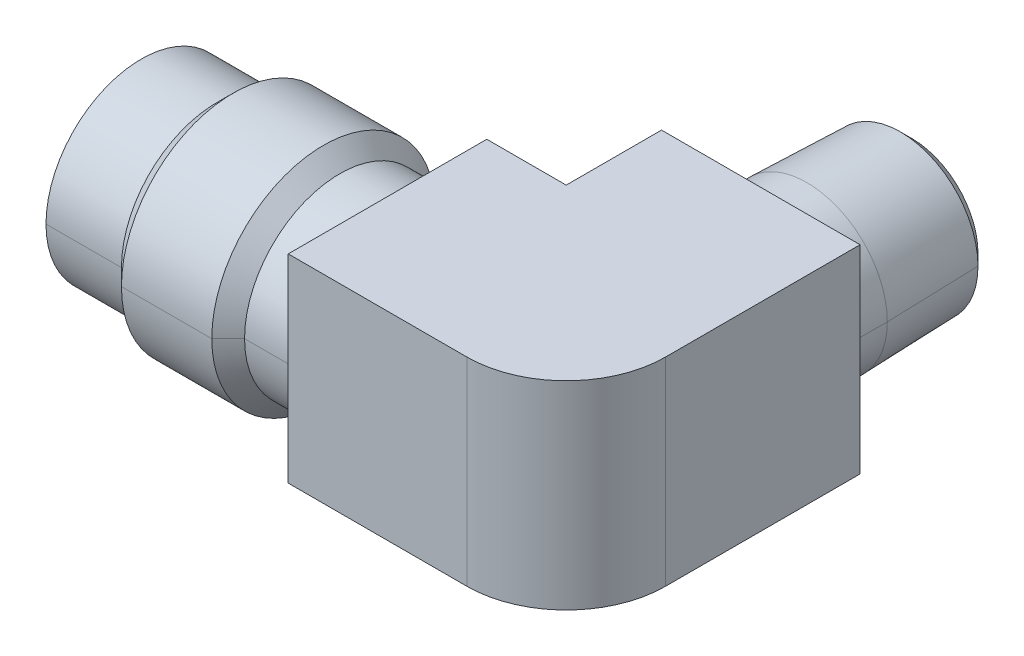
ISO-10303-21;
HEADER;
FILE_DESCRIPTION(('STEP AP214'),'2;1');
FILE_NAME('part.step','',(''),(''),'','','');
FILE_SCHEMA(('AUTOMOTIVE_DESIGN { 1 0 10303 214 1 1 1 1 }'));
ENDSEC;
DATA;
#1=APPLICATION_CONTEXT('core data for automotive mechanical design processes');
#2=APPLICATION_PROTOCOL_DEFINITION('international standard','automotive_design',2000,#1);
#3=PRODUCT_CONTEXT('',#1,'mechanical');
#4=PRODUCT('Part','Part','',(#3));
#5=PRODUCT_RELATED_PRODUCT_CATEGORY('part','',(#4));
#6=PRODUCT_DEFINITION_FORMATION('','',#4);
#7=PRODUCT_DEFINITION_CONTEXT('part definition',#1,'design');
#8=PRODUCT_DEFINITION('design','',#6,#7);
#9=PRODUCT_DEFINITION_SHAPE('','',#8);
#10=(LENGTH_UNIT() NAMED_UNIT(*) SI_UNIT(.MILLI.,.METRE.));
#11=(NAMED_UNIT(*) PLANE_ANGLE_UNIT() SI_UNIT($,.RADIAN.));
#12=(NAMED_UNIT(*) SI_UNIT($,.STERADIAN.) SOLID_ANGLE_UNIT());
#13=UNCERTAINTY_MEASURE_WITH_UNIT(LENGTH_MEASURE(1.E-05),#10,'distance_accuracy_value','');
#14=(GEOMETRIC_REPRESENTATION_CONTEXT(3) GLOBAL_UNCERTAINTY_ASSIGNED_CONTEXT((#13)) GLOBAL_UNIT_ASSIGNED_CONTEXT((#10,
#11,#12)) REPRESENTATION_CONTEXT('',''));
#15=CARTESIAN_POINT('',(0.,0.,0.));
#16=DIRECTION('',(0.,0.,1.));
#17=DIRECTION('',(1.,0.,0.));
#18=AXIS2_PLACEMENT_3D('',#15,#16,#17);
#19=CARTESIAN_POINT('',(27.178,0.,-18.74647));
#20=DIRECTION('',(0.,0.,1.));
#21=DIRECTION('',(-1.,0.,0.));
#22=AXIS2_PLACEMENT_3D('',#19,#20,#21);
#23=CONICAL_SURFACE('',#22,5.03914980109326,0.0311250383214112);
#24=DIRECTION('',(-0.0311200130745938,0.,0.999515655098127));
#25=VECTOR('',#24,1.);
#26=CARTESIAN_POINT('',(22.1388501989067,0.,-18.74647));
#27=LINE('',#26,#25);
#28=CARTESIAN_POINT('',(22.2208896002843,0.,-21.3814196002843));
#29=VERTEX_POINT('',#28);
#30=CARTESIAN_POINT('',(22.0345,0.,-15.39494));
#31=VERTEX_POINT('',#30);
#32=EDGE_CURVE('E18',#29,#31,#27,.T.);
#33=ORIENTED_EDGE('',*,*,#32,.F.);
#34=CARTESIAN_POINT('',(27.178,0.,-21.3814196002843));
#35=DIRECTION('',(0.,0.,1.));
#36=DIRECTION('',(-1.,0.,0.));
#37=AXIS2_PLACEMENT_3D('',#34,#35,#36);
#38=CIRCLE('',#37,4.9571103997157);
#39=CARTESIAN_POINT('',(32.1351103997157,0.,-21.3814196002843));
#40=VERTEX_POINT('',#39);
#41=EDGE_CURVE('E473',#29,#40,#38,.T.);
#42=ORIENTED_EDGE('',*,*,#41,.T.);
#43=DIRECTION('',(-0.0311200130745935,0.,-0.999515655098127));
#44=VECTOR('',#43,1.);
#45=CARTESIAN_POINT('',(32.2171498010933,0.,-18.74647));
#46=LINE('',#45,#44);
#47=CARTESIAN_POINT('',(32.3215,0.,-15.39494));
#48=VERTEX_POINT('',#47);
#49=EDGE_CURVE('E10',#48,#40,#46,.T.);
#50=ORIENTED_EDGE('',*,*,#49,.F.);
#51=CARTESIAN_POINT('',(27.178,0.,-15.39494));
#52=DIRECTION('',(0.,0.,1.));
#53=DIRECTION('',(-1.,0.,0.));
#54=AXIS2_PLACEMENT_3D('',#51,#52,#53);
#55=CIRCLE('',#54,5.1435);
#56=EDGE_CURVE('E446',#31,#48,#55,.T.);
#57=ORIENTED_EDGE('',*,*,#56,.F.);
#58=EDGE_LOOP('',(#33,#42,#50,#57));
#59=FACE_BOUND('',#58,.T.);
#60=ADVANCED_FACE('F15',(#59),#23,.T.);
#61=CARTESIAN_POINT('',(27.178,0.,-18.74647));
#62=DIRECTION('',(0.,0.,1.));
#63=DIRECTION('',(-1.,0.,0.));
#64=AXIS2_PLACEMENT_3D('',#61,#62,#63);
#65=CONICAL_SURFACE('',#64,5.03914980109326,0.0311250383214112);
#66=ORIENTED_EDGE('',*,*,#32,.T.);
#67=CARTESIAN_POINT('',(27.178,0.,-15.39494));
#68=DIRECTION('',(0.,0.,1.));
#69=DIRECTION('',(-1.,0.,0.));
#70=AXIS2_PLACEMENT_3D('',#67,#68,#69);
#71=CIRCLE('',#70,5.1435);
#72=EDGE_CURVE('E442',#48,#31,#71,.T.);
#73=ORIENTED_EDGE('',*,*,#72,.F.);
#74=ORIENTED_EDGE('',*,*,#49,.T.);
#75=CARTESIAN_POINT('',(27.178,0.,-21.3814196002843));
#76=DIRECTION('',(0.,0.,1.));
#77=DIRECTION('',(-1.,0.,0.));
#78=AXIS2_PLACEMENT_3D('',#75,#76,#77);
#79=CIRCLE('',#78,4.9571103997157);
#80=EDGE_CURVE('E472',#40,#29,#79,.T.);
#81=ORIENTED_EDGE('',*,*,#80,.T.);
#82=EDGE_LOOP('',(#66,#73,#74,#81));
#83=FACE_BOUND('',#82,.T.);
#84=ADVANCED_FACE('F497',(#83),#65,.T.);
#85=CARTESIAN_POINT('',(27.178,0.,-21.646515));
#86=DIRECTION('',(0.,0.,1.));
#87=DIRECTION('',(-1.,0.,0.));
#88=AXIS2_PLACEMENT_3D('',#85,#86,#87);
#89=CONICAL_SURFACE('',#88,4.692015,0.785398163397448);
#90=DIRECTION('',(0.707106781186548,0.,-0.707106781186547));
#91=VECTOR('',#90,1.);
#92=CARTESIAN_POINT('',(22.485985,0.,-21.646515));
#93=LINE('',#92,#91);
#94=CARTESIAN_POINT('',(22.93747,0.,-22.098));
#95=VERTEX_POINT('',#94);
#96=EDGE_CURVE('E469',#29,#95,#93,.T.);
#97=ORIENTED_EDGE('',*,*,#96,.T.);
#98=CARTESIAN_POINT('',(27.178,0.,-22.098));
#99=DIRECTION('',(0.,0.,-1.));
#100=DIRECTION('',(-1.,0.,0.));
#101=AXIS2_PLACEMENT_3D('',#98,#99,#100);
#102=CIRCLE('',#101,4.24053);
#103=CARTESIAN_POINT('',(31.41853,0.,-22.098));
#104=VERTEX_POINT('',#103);
#105=EDGE_CURVE('E346',#104,#95,#102,.T.);
#106=ORIENTED_EDGE('',*,*,#105,.F.);
#107=DIRECTION('',(0.707106781186548,0.,0.707106781186547));
#108=VECTOR('',#107,1.);
#109=CARTESIAN_POINT('',(31.870015,0.,-21.646515));
#110=LINE('',#109,#108);
#111=EDGE_CURVE('E478',#104,#40,#110,.T.);
#112=ORIENTED_EDGE('',*,*,#111,.T.);
#113=ORIENTED_EDGE('',*,*,#41,.F.);
#114=EDGE_LOOP('',(#97,#106,#112,#113));
#115=FACE_BOUND('',#114,.T.);
#116=ADVANCED_FACE('F503',(#115),#89,.T.);
#117=CARTESIAN_POINT('',(27.178,0.,-13.92047));
#118=DIRECTION('',(0.,0.,1.));
#119=DIRECTION('',(-1.,0.,0.));
#120=AXIS2_PLACEMENT_3D('',#117,#118,#119);
#121=CYLINDRICAL_SURFACE('',#120,5.1435);
#122=DIRECTION('',(0.,0.,1.));
#123=VECTOR('',#122,1.);
#124=CARTESIAN_POINT('',(22.0345,0.,-13.92047));
#125=LINE('',#124,#123);
#126=CARTESIAN_POINT('',(22.0345,0.,-12.446));
#127=VERTEX_POINT('',#126);
#128=EDGE_CURVE('E482',#31,#127,#125,.T.);
#129=ORIENTED_EDGE('',*,*,#128,.F.);
#130=ORIENTED_EDGE('',*,*,#56,.T.);
#131=DIRECTION('',(0.,0.,-1.));
#132=VECTOR('',#131,1.);
#133=CARTESIAN_POINT('',(32.3215,0.,-13.92047));
#134=LINE('',#133,#132);
#135=CARTESIAN_POINT('',(32.3215,0.,-12.446));
#136=VERTEX_POINT('',#135);
#137=EDGE_CURVE('E447',#136,#48,#134,.T.);
#138=ORIENTED_EDGE('',*,*,#137,.F.);
#139=CARTESIAN_POINT('',(27.178,0.,-12.446));
#140=DIRECTION('',(0.,0.,1.));
#141=DIRECTION('',(-1.,0.,0.));
#142=AXIS2_PLACEMENT_3D('',#139,#140,#141);
#143=CIRCLE('',#142,5.1435);
#144=EDGE_CURVE('E290',#127,#136,#143,.T.);
#145=ORIENTED_EDGE('',*,*,#144,.F.);
#146=EDGE_LOOP('',(#129,#130,#138,#145));
#147=FACE_BOUND('',#146,.T.);
#148=ADVANCED_FACE('F496',(#147),#121,.T.);
#149=CARTESIAN_POINT('',(27.178,0.,-13.92047));
#150=DIRECTION('',(0.,0.,1.));
#151=DIRECTION('',(-1.,0.,0.));
#152=AXIS2_PLACEMENT_3D('',#149,#150,#151);
#153=CYLINDRICAL_SURFACE('',#152,5.1435);
#154=ORIENTED_EDGE('',*,*,#128,.T.);
#155=CARTESIAN_POINT('',(27.178,0.,-12.446));
#156=DIRECTION('',(0.,0.,1.));
#157=DIRECTION('',(-1.,0.,0.));
#158=AXIS2_PLACEMENT_3D('',#155,#156,#157);
#159=CIRCLE('',#158,5.1435);
#160=EDGE_CURVE('E299',#136,#127,#159,.T.);
#161=ORIENTED_EDGE('',*,*,#160,.F.);
#162=ORIENTED_EDGE('',*,*,#137,.T.);
#163=ORIENTED_EDGE('',*,*,#72,.T.);
#164=EDGE_LOOP('',(#154,#161,#162,#163));
#165=FACE_BOUND('',#164,.T.);
#166=ADVANCED_FACE('F492',(#165),#153,.T.);
#167=CARTESIAN_POINT('',(27.178,0.,-21.646515));
#168=DIRECTION('',(0.,0.,1.));
#169=DIRECTION('',(-1.,0.,0.));
#170=AXIS2_PLACEMENT_3D('',#167,#168,#169);
#171=CONICAL_SURFACE('',#170,4.692015,0.785398163397448);
#172=ORIENTED_EDGE('',*,*,#96,.F.);
#173=ORIENTED_EDGE('',*,*,#80,.F.);
#174=ORIENTED_EDGE('',*,*,#111,.F.);
#175=CARTESIAN_POINT('',(27.178,0.,-22.098));
#176=DIRECTION('',(0.,0.,-1.));
#177=DIRECTION('',(-1.,0.,0.));
#178=AXIS2_PLACEMENT_3D('',#175,#176,#177);
#179=CIRCLE('',#178,4.24053);
#180=EDGE_CURVE('E342',#95,#104,#179,.T.);
#181=ORIENTED_EDGE('',*,*,#180,.F.);
#182=EDGE_LOOP('',(#172,#173,#174,#181));
#183=FACE_BOUND('',#182,.T.);
#184=ADVANCED_FACE('F506',(#183),#171,.T.);
#185=CARTESIAN_POINT('',(24.7106001989067,0.,-22.098));
#186=DIRECTION('',(0.,0.,-1.));
#187=DIRECTION('',(0.,-1.,0.));
#188=AXIS2_PLACEMENT_3D('',#185,#186,#187);
#189=PLANE('',#188);
#190=ORIENTED_EDGE('',*,*,#180,.T.);
#191=ORIENTED_EDGE('',*,*,#105,.T.);
#192=EDGE_LOOP('',(#190,#191));
#193=FACE_BOUND('',#192,.T.);
#194=CARTESIAN_POINT('',(27.178,0.,-22.098));
#195=DIRECTION('',(0.,0.,1.));
#196=DIRECTION('',(-1.,0.,0.));
#197=AXIS2_PLACEMENT_3D('',#194,#195,#196);
#198=CIRCLE('',#197,2.286);
#199=CARTESIAN_POINT('',(24.892,0.,-22.098));
#200=VERTEX_POINT('',#199);
#201=CARTESIAN_POINT('',(29.464,0.,-22.098));
#202=VERTEX_POINT('',#201);
#203=EDGE_CURVE('E288',#200,#202,#198,.T.);
#204=ORIENTED_EDGE('',*,*,#203,.T.);
#205=CARTESIAN_POINT('',(27.178,0.,-22.098));
#206=DIRECTION('',(0.,0.,1.));
#207=DIRECTION('',(-1.,0.,0.));
#208=AXIS2_PLACEMENT_3D('',#205,#206,#207);
#209=CIRCLE('',#208,2.286);
#210=EDGE_CURVE('E278',#202,#200,#209,.T.);
#211=ORIENTED_EDGE('',*,*,#210,.T.);
#212=EDGE_LOOP('',(#204,#211));
#213=FACE_BOUND('',#212,.T.);
#214=ADVANCED_FACE('F508',(#193,#213),#189,.T.);
#215=CARTESIAN_POINT('',(30.353,0.,-12.446));
#216=DIRECTION('',(0.,0.,-1.));
#217=DIRECTION('',(0.,-1.,0.));
#218=AXIS2_PLACEMENT_3D('',#215,#216,#217);
#219=PLANE('',#218);
#220=ORIENTED_EDGE('',*,*,#144,.T.);
#221=ORIENTED_EDGE('',*,*,#160,.T.);
#222=EDGE_LOOP('',(#220,#221));
#223=FACE_BOUND('',#222,.T.);
#224=DIRECTION('',(1.,0.,0.));
#225=VECTOR('',#224,1.);
#226=CARTESIAN_POINT('',(20.828,-6.35,-12.446));
#227=LINE('',#226,#225);
#228=CARTESIAN_POINT('',(20.828,-6.35,-12.446));
#229=VERTEX_POINT('',#228);
#230=CARTESIAN_POINT('',(33.528,-6.35,-12.446));
#231=VERTEX_POINT('',#230);
#232=EDGE_CURVE('E279',#229,#231,#227,.T.);
#233=ORIENTED_EDGE('',*,*,#232,.F.);
#234=DIRECTION('',(0.,-1.,0.));
#235=VECTOR('',#234,1.);
#236=CARTESIAN_POINT('',(20.828,6.35,-12.446));
#237=LINE('',#236,#235);
#238=CARTESIAN_POINT('',(20.828,6.35,-12.446));
#239=VERTEX_POINT('',#238);
#240=EDGE_CURVE('E441',#239,#229,#237,.T.);
#241=ORIENTED_EDGE('',*,*,#240,.F.);
#242=DIRECTION('',(-1.,0.,0.));
#243=VECTOR('',#242,1.);
#244=CARTESIAN_POINT('',(33.528,6.35,-12.446));
#245=LINE('',#244,#243);
#246=CARTESIAN_POINT('',(33.528,6.35,-12.446));
#247=VERTEX_POINT('',#246);
#248=EDGE_CURVE('E378',#247,#239,#245,.T.);
#249=ORIENTED_EDGE('',*,*,#248,.F.);
#250=DIRECTION('',(0.,1.,0.));
#251=VECTOR('',#250,1.);
#252=CARTESIAN_POINT('',(33.528,-6.35,-12.446));
#253=LINE('',#252,#251);
#254=EDGE_CURVE('E427',#231,#247,#253,.T.);
#255=ORIENTED_EDGE('',*,*,#254,.F.);
#256=EDGE_LOOP('',(#233,#241,#249,#255));
#257=FACE_BOUND('',#256,.T.);
#258=ADVANCED_FACE('F511',(#223,#257),#219,.T.);
#259=CARTESIAN_POINT('',(27.178,0.,-17.272));
#260=DIRECTION('',(0.,0.,-1.));
#261=DIRECTION('',(-1.,0.,0.));
#262=AXIS2_PLACEMENT_3D('',#259,#260,#261);
#263=CYLINDRICAL_SURFACE('',#262,2.286);
#264=DIRECTION('',(0.,0.,1.));
#265=VECTOR('',#264,1.);
#266=CARTESIAN_POINT('',(24.892,0.,-17.272));
#267=LINE('',#266,#265);
#268=CARTESIAN_POINT('',(24.892,0.,-2.286));
#269=VERTEX_POINT('',#268);
#270=EDGE_CURVE('E275',#200,#269,#267,.T.);
#271=ORIENTED_EDGE('',*,*,#270,.T.);
#272=CARTESIAN_POINT('',(27.178,0.,0.));
#273=DIRECTION('',(0.707106781186547,0.,-0.707106781186548));
#274=DIRECTION('',(0.707106781186548,0.,0.707106781186547));
#275=AXIS2_PLACEMENT_3D('',#272,#273,#274);
#276=ELLIPSE('',#275,3.23289220358489,2.286);
#277=CARTESIAN_POINT('',(27.178,-2.286,0.));
#278=VERTEX_POINT('',#277);
#279=EDGE_CURVE('E423',#278,#269,#276,.T.);
#280=ORIENTED_EDGE('',*,*,#279,.F.);
#281=CARTESIAN_POINT('',(27.178,0.,0.));
#282=DIRECTION('',(0.,0.,1.));
#283=DIRECTION('',(1.,0.,0.));
#284=AXIS2_PLACEMENT_3D('',#281,#282,#283);
#285=CIRCLE('',#284,2.286);
#286=CARTESIAN_POINT('',(29.464,0.,0.));
#287=VERTEX_POINT('',#286);
#288=EDGE_CURVE('E353',#278,#287,#285,.T.);
#289=ORIENTED_EDGE('',*,*,#288,.T.);
#290=DIRECTION('',(0.,0.,-1.));
#291=VECTOR('',#290,1.);
#292=CARTESIAN_POINT('',(29.464,0.,-17.272));
#293=LINE('',#292,#291);
#294=EDGE_CURVE('E291',#287,#202,#293,.T.);
#295=ORIENTED_EDGE('',*,*,#294,.T.);
#296=ORIENTED_EDGE('',*,*,#203,.F.);
#297=EDGE_LOOP('',(#271,#280,#289,#295,#296));
#298=FACE_BOUND('',#297,.T.);
#299=ADVANCED_FACE('F516',(#298),#263,.F.);
#300=CARTESIAN_POINT('',(27.178,0.,-17.272));
#301=DIRECTION('',(0.,0.,-1.));
#302=DIRECTION('',(-1.,0.,0.));
#303=AXIS2_PLACEMENT_3D('',#300,#301,#302);
#304=CYLINDRICAL_SURFACE('',#303,2.286);
#305=ORIENTED_EDGE('',*,*,#270,.F.);
#306=ORIENTED_EDGE('',*,*,#210,.F.);
#307=ORIENTED_EDGE('',*,*,#294,.F.);
#308=CARTESIAN_POINT('',(27.178,0.,0.));
#309=DIRECTION('',(0.,0.,1.));
#310=DIRECTION('',(1.,0.,0.));
#311=AXIS2_PLACEMENT_3D('',#308,#309,#310);
#312=CIRCLE('',#311,2.286);
#313=CARTESIAN_POINT('',(27.178,2.286,0.));
#314=VERTEX_POINT('',#313);
#315=EDGE_CURVE('E337',#287,#314,#312,.T.);
#316=ORIENTED_EDGE('',*,*,#315,.T.);
#317=CARTESIAN_POINT('',(27.178,0.,0.));
#318=DIRECTION('',(0.707106781186547,0.,-0.707106781186548));
#319=DIRECTION('',(0.707106781186548,0.,0.707106781186547));
#320=AXIS2_PLACEMENT_3D('',#317,#318,#319);
#321=ELLIPSE('',#320,3.23289220358489,2.286);
#322=EDGE_CURVE('E409',#269,#314,#321,.T.);
#323=ORIENTED_EDGE('',*,*,#322,.F.);
#324=EDGE_LOOP('',(#305,#306,#307,#316,#323));
#325=FACE_BOUND('',#324,.T.);
#326=ADVANCED_FACE('F520',(#325),#304,.F.);
#327=CARTESIAN_POINT('',(15.748,-6.35,-6.35));
#328=DIRECTION('',(0.,-1.,0.));
#329=DIRECTION('',(-1.,0.,0.));
#330=AXIS2_PLACEMENT_3D('',#327,#328,#329);
#331=PLANE('',#330);
#332=DIRECTION('',(1.,0.,0.));
#333=VECTOR('',#332,1.);
#334=CARTESIAN_POINT('',(15.748,-6.35,6.35));
#335=LINE('',#334,#333);
#336=CARTESIAN_POINT('',(15.748,-6.35,6.35));
#337=VERTEX_POINT('',#336);
#338=CARTESIAN_POINT('',(27.178,-6.35,6.35));
#339=VERTEX_POINT('',#338);
#340=EDGE_CURVE('E307',#337,#339,#335,.T.);
#341=ORIENTED_EDGE('',*,*,#340,.F.);
#342=DIRECTION('',(0.,0.,-1.));
#343=VECTOR('',#342,1.);
#344=CARTESIAN_POINT('',(15.748,-6.35,6.35));
#345=LINE('',#344,#343);
#346=CARTESIAN_POINT('',(15.748,-6.35,-6.35));
#347=VERTEX_POINT('',#346);
#348=EDGE_CURVE('E267',#337,#347,#345,.T.);
#349=ORIENTED_EDGE('',*,*,#348,.T.);
#350=DIRECTION('',(1.,0.,0.));
#351=VECTOR('',#350,1.);
#352=CARTESIAN_POINT('',(15.748,-6.35,-6.35));
#353=LINE('',#352,#351);
#354=CARTESIAN_POINT('',(20.828,-6.35,-6.35));
#355=VERTEX_POINT('',#354);
#356=EDGE_CURVE('E387',#347,#355,#353,.T.);
#357=ORIENTED_EDGE('',*,*,#356,.T.);
#358=DIRECTION('',(0.,0.,-1.));
#359=VECTOR('',#358,1.);
#360=CARTESIAN_POINT('',(20.828,-6.35,0.));
#361=LINE('',#360,#359);
#362=EDGE_CURVE('E451',#355,#229,#361,.T.);
#363=ORIENTED_EDGE('',*,*,#362,.T.);
#364=ORIENTED_EDGE('',*,*,#232,.T.);
#365=DIRECTION('',(0.,0.,-1.));
#366=VECTOR('',#365,1.);
#367=CARTESIAN_POINT('',(33.528,-6.35,0.));
#368=LINE('',#367,#366);
#369=CARTESIAN_POINT('',(33.528,-6.35,0.));
#370=VERTEX_POINT('',#369);
#371=EDGE_CURVE('E383',#370,#231,#368,.T.);
#372=ORIENTED_EDGE('',*,*,#371,.F.);
#373=CARTESIAN_POINT('',(27.178,-6.35,0.));
#374=DIRECTION('',(0.,-1.,0.));
#375=DIRECTION('',(1.,0.,0.));
#376=AXIS2_PLACEMENT_3D('',#373,#374,#375);
#377=CIRCLE('',#376,6.35);
#378=EDGE_CURVE('E365',#370,#339,#377,.T.);
#379=ORIENTED_EDGE('',*,*,#378,.T.);
#380=EDGE_LOOP('',(#341,#349,#357,#363,#364,#372,#379));
#381=FACE_BOUND('',#380,.T.);
#382=ADVANCED_FACE('F571',(#381),#331,.T.);
#383=CARTESIAN_POINT('',(20.828,6.35,0.));
#384=DIRECTION('',(-1.,0.,0.));
#385=DIRECTION('',(0.,0.,1.));
#386=AXIS2_PLACEMENT_3D('',#383,#384,#385);
#387=PLANE('',#386);
#388=DIRECTION('',(0.,-1.,0.));
#389=VECTOR('',#388,1.);
#390=CARTESIAN_POINT('',(20.828,6.35,-6.35));
#391=LINE('',#390,#389);
#392=CARTESIAN_POINT('',(20.828,6.35,-6.35));
#393=VERTEX_POINT('',#392);
#394=EDGE_CURVE('E377',#393,#355,#391,.T.);
#395=ORIENTED_EDGE('',*,*,#394,.F.);
#396=DIRECTION('',(0.,0.,-1.));
#397=VECTOR('',#396,1.);
#398=CARTESIAN_POINT('',(20.828,6.35,0.));
#399=LINE('',#398,#397);
#400=EDGE_CURVE('E382',#393,#239,#399,.T.);
#401=ORIENTED_EDGE('',*,*,#400,.T.);
#402=ORIENTED_EDGE('',*,*,#240,.T.);
#403=ORIENTED_EDGE('',*,*,#362,.F.);
#404=EDGE_LOOP('',(#395,#401,#402,#403));
#405=FACE_BOUND('',#404,.T.);
#406=ADVANCED_FACE('F574',(#405),#387,.T.);
#407=CARTESIAN_POINT('',(15.748,6.35,6.35));
#408=DIRECTION('',(0.,1.,0.));
#409=DIRECTION('',(1.,0.,0.));
#410=AXIS2_PLACEMENT_3D('',#407,#408,#409);
#411=PLANE('',#410);
#412=DIRECTION('',(0.,0.,-1.));
#413=VECTOR('',#412,1.);
#414=CARTESIAN_POINT('',(33.528,6.35,0.));
#415=LINE('',#414,#413);
#416=CARTESIAN_POINT('',(33.528,6.35,0.));
#417=VERTEX_POINT('',#416);
#418=EDGE_CURVE('E431',#417,#247,#415,.T.);
#419=ORIENTED_EDGE('',*,*,#418,.T.);
#420=ORIENTED_EDGE('',*,*,#248,.T.);
#421=ORIENTED_EDGE('',*,*,#400,.F.);
#422=DIRECTION('',(1.,0.,0.));
#423=VECTOR('',#422,1.);
#424=CARTESIAN_POINT('',(15.748,6.35,-6.35));
#425=LINE('',#424,#423);
#426=CARTESIAN_POINT('',(15.748,6.35,-6.35));
#427=VERTEX_POINT('',#426);
#428=EDGE_CURVE('E394',#427,#393,#425,.T.);
#429=ORIENTED_EDGE('',*,*,#428,.F.);
#430=DIRECTION('',(0.,0.,1.));
#431=VECTOR('',#430,1.);
#432=CARTESIAN_POINT('',(15.748,6.35,-6.35));
#433=LINE('',#432,#431);
#434=CARTESIAN_POINT('',(15.748,6.35,6.35));
#435=VERTEX_POINT('',#434);
#436=EDGE_CURVE('E266',#427,#435,#433,.T.);
#437=ORIENTED_EDGE('',*,*,#436,.T.);
#438=DIRECTION('',(1.,0.,0.));
#439=VECTOR('',#438,1.);
#440=CARTESIAN_POINT('',(15.748,6.35,6.35));
#441=LINE('',#440,#439);
#442=CARTESIAN_POINT('',(27.178,6.35,6.35));
#443=VERTEX_POINT('',#442);
#444=EDGE_CURVE('E310',#435,#443,#441,.T.);
#445=ORIENTED_EDGE('',*,*,#444,.T.);
#446=CARTESIAN_POINT('',(27.178,6.35,0.));
#447=DIRECTION('',(0.,-1.,0.));
#448=DIRECTION('',(1.,0.,0.));
#449=AXIS2_PLACEMENT_3D('',#446,#447,#448);
#450=CIRCLE('',#449,6.35);
#451=EDGE_CURVE('E373',#417,#443,#450,.T.);
#452=ORIENTED_EDGE('',*,*,#451,.F.);
#453=EDGE_LOOP('',(#419,#420,#421,#429,#437,#445,#452));
#454=FACE_BOUND('',#453,.T.);
#455=ADVANCED_FACE('F578',(#454),#411,.T.);
#456=CARTESIAN_POINT('',(33.528,-6.35,0.));
#457=DIRECTION('',(1.,0.,0.));
#458=DIRECTION('',(0.,1.,0.));
#459=AXIS2_PLACEMENT_3D('',#456,#457,#458);
#460=PLANE('',#459);
#461=ORIENTED_EDGE('',*,*,#254,.T.);
#462=ORIENTED_EDGE('',*,*,#418,.F.);
#463=DIRECTION('',(0.,1.,0.));
#464=VECTOR('',#463,1.);
#465=CARTESIAN_POINT('',(33.528,-6.35,0.));
#466=LINE('',#465,#464);
#467=EDGE_CURVE('E369',#370,#417,#466,.T.);
#468=ORIENTED_EDGE('',*,*,#467,.F.);
#469=ORIENTED_EDGE('',*,*,#371,.T.);
#470=EDGE_LOOP('',(#461,#462,#468,#469));
#471=FACE_BOUND('',#470,.T.);
#472=ADVANCED_FACE('F582',(#471),#460,.T.);
#473=CARTESIAN_POINT('',(21.463,0.,0.));
#474=DIRECTION('',(1.,0.,0.));
#475=DIRECTION('',(0.,0.,-1.));
#476=AXIS2_PLACEMENT_3D('',#473,#474,#475);
#477=CYLINDRICAL_SURFACE('',#476,2.286);
#478=DIRECTION('',(-1.,0.,0.));
#479=VECTOR('',#478,1.);
#480=CARTESIAN_POINT('',(21.463,0.,-2.286));
#481=LINE('',#480,#479);
#482=CARTESIAN_POINT('',(0.,0.,-2.286));
#483=VERTEX_POINT('',#482);
#484=EDGE_CURVE('E406',#269,#483,#481,.T.);
#485=ORIENTED_EDGE('',*,*,#484,.T.);
#486=CARTESIAN_POINT('',(0.,0.,0.));
#487=DIRECTION('',(1.,0.,0.));
#488=DIRECTION('',(0.,0.,1.));
#489=AXIS2_PLACEMENT_3D('',#486,#487,#488);
#490=CIRCLE('',#489,2.286);
#491=CARTESIAN_POINT('',(0.,0.,2.286));
#492=VERTEX_POINT('',#491);
#493=EDGE_CURVE('E341',#492,#483,#490,.T.);
#494=ORIENTED_EDGE('',*,*,#493,.F.);
#495=DIRECTION('',(1.,0.,0.));
#496=VECTOR('',#495,1.);
#497=CARTESIAN_POINT('',(21.463,0.,2.286));
#498=LINE('',#497,#496);
#499=CARTESIAN_POINT('',(27.178,0.,2.286));
#500=VERTEX_POINT('',#499);
#501=EDGE_CURVE('E338',#492,#500,#498,.T.);
#502=ORIENTED_EDGE('',*,*,#501,.T.);
#503=CARTESIAN_POINT('',(27.178,0.,0.));
#504=DIRECTION('',(1.,0.,0.));
#505=DIRECTION('',(0.,0.,-1.));
#506=AXIS2_PLACEMENT_3D('',#503,#504,#505);
#507=CIRCLE('',#506,2.286);
#508=EDGE_CURVE('E419',#500,#278,#507,.T.);
#509=ORIENTED_EDGE('',*,*,#508,.T.);
#510=ORIENTED_EDGE('',*,*,#279,.T.);
#511=EDGE_LOOP('',(#485,#494,#502,#509,#510));
#512=FACE_BOUND('',#511,.T.);
#513=ADVANCED_FACE('F524',(#512),#477,.F.);
#514=CARTESIAN_POINT('',(27.178,0.,0.));
#515=DIRECTION('',(0.,0.,1.));
#516=DIRECTION('',(1.,0.,0.));
#517=AXIS2_PLACEMENT_3D('',#514,#515,#516);
#518=SPHERICAL_SURFACE('',#517,2.286);
#519=CARTESIAN_POINT('',(27.178,0.,0.));
#520=DIRECTION('',(0.,1.,0.));
#521=DIRECTION('',(0.,0.,1.));
#522=AXIS2_PLACEMENT_3D('',#519,#520,#521);
#523=CIRCLE('',#522,2.286);
#524=EDGE_CURVE('E333',#500,#287,#523,.T.);
#525=ORIENTED_EDGE('',*,*,#524,.T.);
#526=ORIENTED_EDGE('',*,*,#288,.F.);
#527=ORIENTED_EDGE('',*,*,#508,.F.);
#528=EDGE_LOOP('',(#525,#526,#527));
#529=FACE_BOUND('',#528,.T.);
#530=ADVANCED_FACE('F529',(#529),#518,.F.);
#531=CARTESIAN_POINT('',(27.178,0.,0.));
#532=DIRECTION('',(0.,0.,1.));
#533=DIRECTION('',(1.,0.,0.));
#534=AXIS2_PLACEMENT_3D('',#531,#532,#533);
#535=SPHERICAL_SURFACE('',#534,2.286);
#536=ORIENTED_EDGE('',*,*,#524,.F.);
#537=CARTESIAN_POINT('',(27.178,0.,0.));
#538=DIRECTION('',(1.,0.,0.));
#539=DIRECTION('',(0.,0.,-1.));
#540=AXIS2_PLACEMENT_3D('',#537,#538,#539);
#541=CIRCLE('',#540,2.286);
#542=EDGE_CURVE('E357',#314,#500,#541,.T.);
#543=ORIENTED_EDGE('',*,*,#542,.F.);
#544=ORIENTED_EDGE('',*,*,#315,.F.);
#545=EDGE_LOOP('',(#536,#543,#544));
#546=FACE_BOUND('',#545,.T.);
#547=ADVANCED_FACE('F532',(#546),#535,.F.);
#548=CARTESIAN_POINT('',(21.463,0.,0.));
#549=DIRECTION('',(1.,0.,0.));
#550=DIRECTION('',(0.,0.,-1.));
#551=AXIS2_PLACEMENT_3D('',#548,#549,#550);
#552=CYLINDRICAL_SURFACE('',#551,2.286);
#553=ORIENTED_EDGE('',*,*,#484,.F.);
#554=ORIENTED_EDGE('',*,*,#322,.T.);
#555=ORIENTED_EDGE('',*,*,#542,.T.);
#556=ORIENTED_EDGE('',*,*,#501,.F.);
#557=CARTESIAN_POINT('',(0.,0.,0.));
#558=DIRECTION('',(1.,0.,0.));
#559=DIRECTION('',(0.,0.,1.));
#560=AXIS2_PLACEMENT_3D('',#557,#558,#559);
#561=CIRCLE('',#560,2.286);
#562=EDGE_CURVE('E350',#483,#492,#561,.T.);
#563=ORIENTED_EDGE('',*,*,#562,.F.);
#564=EDGE_LOOP('',(#553,#554,#555,#556,#563));
#565=FACE_BOUND('',#564,.T.);
#566=ADVANCED_FACE('F534',(#565),#552,.F.);
#567=CARTESIAN_POINT('',(15.748,-6.35,6.35));
#568=DIRECTION('',(0.,0.,1.));
#569=DIRECTION('',(1.,0.,0.));
#570=AXIS2_PLACEMENT_3D('',#567,#568,#569);
#571=PLANE('',#570);
#572=DIRECTION('',(0.,-1.,0.));
#573=VECTOR('',#572,1.);
#574=CARTESIAN_POINT('',(15.748,6.35,6.35));
#575=LINE('',#574,#573);
#576=EDGE_CURVE('E262',#435,#337,#575,.T.);
#577=ORIENTED_EDGE('',*,*,#576,.T.);
#578=ORIENTED_EDGE('',*,*,#340,.T.);
#579=DIRECTION('',(0.,1.,0.));
#580=VECTOR('',#579,1.);
#581=CARTESIAN_POINT('',(27.178,6.35,6.35));
#582=LINE('',#581,#580);
#583=EDGE_CURVE('E361',#339,#443,#582,.T.);
#584=ORIENTED_EDGE('',*,*,#583,.T.);
#585=ORIENTED_EDGE('',*,*,#444,.F.);
#586=EDGE_LOOP('',(#577,#578,#584,#585));
#587=FACE_BOUND('',#586,.T.);
#588=ADVANCED_FACE('F595',(#587),#571,.T.);
#589=CARTESIAN_POINT('',(15.748,0.,-3.175));
#590=DIRECTION('',(-1.,0.,0.));
#591=DIRECTION('',(0.,0.,1.));
#592=AXIS2_PLACEMENT_3D('',#589,#590,#591);
#593=PLANE('',#592);
#594=ORIENTED_EDGE('',*,*,#348,.F.);
#595=ORIENTED_EDGE('',*,*,#576,.F.);
#596=ORIENTED_EDGE('',*,*,#436,.F.);
#597=DIRECTION('',(0.,1.,0.));
#598=VECTOR('',#597,1.);
#599=CARTESIAN_POINT('',(15.748,-6.35,-6.35));
#600=LINE('',#599,#598);
#601=EDGE_CURVE('E391',#347,#427,#600,.T.);
#602=ORIENTED_EDGE('',*,*,#601,.F.);
#603=EDGE_LOOP('',(#594,#595,#596,#602));
#604=FACE_BOUND('',#603,.T.);
#605=CARTESIAN_POINT('',(15.748,0.,0.));
#606=DIRECTION('',(1.,0.,0.));
#607=DIRECTION('',(0.,0.,1.));
#608=AXIS2_PLACEMENT_3D('',#605,#606,#607);
#609=CIRCLE('',#608,6.096);
#610=CARTESIAN_POINT('',(15.748,0.,6.096));
#611=VERTEX_POINT('',#610);
#612=CARTESIAN_POINT('',(15.748,0.,-6.096));
#613=VERTEX_POINT('',#612);
#614=EDGE_CURVE('E332',#611,#613,#609,.T.);
#615=ORIENTED_EDGE('',*,*,#614,.T.);
#616=CARTESIAN_POINT('',(15.748,0.,0.));
#617=DIRECTION('',(1.,0.,0.));
#618=DIRECTION('',(0.,0.,1.));
#619=AXIS2_PLACEMENT_3D('',#616,#617,#618);
#620=CIRCLE('',#619,6.096);
#621=EDGE_CURVE('E303',#613,#611,#620,.T.);
#622=ORIENTED_EDGE('',*,*,#621,.T.);
#623=EDGE_LOOP('',(#615,#622));
#624=FACE_BOUND('',#623,.T.);
#625=ADVANCED_FACE('F598',(#604,#624),#593,.T.);
#626=CARTESIAN_POINT('',(15.748,6.35,-6.35));
#627=DIRECTION('',(0.,0.,-1.));
#628=DIRECTION('',(0.,-1.,0.));
#629=AXIS2_PLACEMENT_3D('',#626,#627,#628);
#630=PLANE('',#629);
#631=ORIENTED_EDGE('',*,*,#394,.T.);
#632=ORIENTED_EDGE('',*,*,#356,.F.);
#633=ORIENTED_EDGE('',*,*,#601,.T.);
#634=ORIENTED_EDGE('',*,*,#428,.T.);
#635=EDGE_LOOP('',(#631,#632,#633,#634));
#636=FACE_BOUND('',#635,.T.);
#637=ADVANCED_FACE('F550',(#636),#630,.T.);
#638=CARTESIAN_POINT('',(27.178,0.,0.));
#639=DIRECTION('',(0.,-1.,0.));
#640=DIRECTION('',(1.,0.,0.));
#641=AXIS2_PLACEMENT_3D('',#638,#639,#640);
#642=CYLINDRICAL_SURFACE('',#641,6.35);
#643=ORIENTED_EDGE('',*,*,#583,.F.);
#644=ORIENTED_EDGE('',*,*,#378,.F.);
#645=ORIENTED_EDGE('',*,*,#467,.T.);
#646=ORIENTED_EDGE('',*,*,#451,.T.);
#647=EDGE_LOOP('',(#643,#644,#645,#646));
#648=FACE_BOUND('',#647,.T.);
#649=ADVANCED_FACE('F539',(#648),#642,.T.);
#650=CARTESIAN_POINT('',(0.,0.,3.048));
#651=DIRECTION('',(-1.,0.,0.));
#652=DIRECTION('',(0.,1.,0.));
#653=AXIS2_PLACEMENT_3D('',#650,#651,#652);
#654=PLANE('',#653);
#655=CARTESIAN_POINT('',(0.,0.,0.));
#656=DIRECTION('',(-1.,0.,0.));
#657=DIRECTION('',(0.,0.,1.));
#658=AXIS2_PLACEMENT_3D('',#655,#656,#657);
#659=CIRCLE('',#658,6.096);
#660=CARTESIAN_POINT('',(0.,0.,6.096));
#661=VERTEX_POINT('',#660);
#662=CARTESIAN_POINT('',(0.,0.,-6.096));
#663=VERTEX_POINT('',#662);
#664=EDGE_CURVE('E224',#661,#663,#659,.T.);
#665=ORIENTED_EDGE('',*,*,#664,.T.);
#666=CARTESIAN_POINT('',(0.,0.,0.));
#667=DIRECTION('',(-1.,0.,0.));
#668=DIRECTION('',(0.,0.,1.));
#669=AXIS2_PLACEMENT_3D('',#666,#667,#668);
#670=CIRCLE('',#669,6.096);
#671=EDGE_CURVE('E221',#663,#661,#670,.T.);
#672=ORIENTED_EDGE('',*,*,#671,.T.);
#673=EDGE_LOOP('',(#665,#672));
#674=FACE_BOUND('',#673,.T.);
#675=ORIENTED_EDGE('',*,*,#493,.T.);
#676=ORIENTED_EDGE('',*,*,#562,.T.);
#677=EDGE_LOOP('',(#675,#676));
#678=FACE_BOUND('',#677,.T.);
#679=ADVANCED_FACE('F536',(#674,#678),#654,.T.);
#680=CARTESIAN_POINT('',(14.224,0.,0.));
#681=DIRECTION('',(-1.,0.,0.));
#682=DIRECTION('',(0.,0.,1.));
#683=AXIS2_PLACEMENT_3D('',#680,#681,#682);
#684=CYLINDRICAL_SURFACE('',#683,6.096);
#685=DIRECTION('',(-1.,0.,0.));
#686=VECTOR('',#685,1.);
#687=CARTESIAN_POINT('',(14.224,0.,6.096));
#688=LINE('',#687,#686);
#689=CARTESIAN_POINT('',(12.7,0.,6.096));
#690=VERTEX_POINT('',#689);
#691=EDGE_CURVE('E300',#611,#690,#688,.T.);
#692=ORIENTED_EDGE('',*,*,#691,.T.);
#693=CARTESIAN_POINT('',(12.7,0.,0.));
#694=DIRECTION('',(-1.,0.,0.));
#695=DIRECTION('',(0.,0.,1.));
#696=AXIS2_PLACEMENT_3D('',#693,#694,#695);
#697=CIRCLE('',#696,6.096);
#698=CARTESIAN_POINT('',(12.7,0.,-6.096));
#699=VERTEX_POINT('',#698);
#700=EDGE_CURVE('E287',#699,#690,#697,.T.);
#701=ORIENTED_EDGE('',*,*,#700,.F.);
#702=DIRECTION('',(1.,0.,0.));
#703=VECTOR('',#702,1.);
#704=CARTESIAN_POINT('',(14.224,0.,-6.096));
#705=LINE('',#704,#703);
#706=EDGE_CURVE('E323',#699,#613,#705,.T.);
#707=ORIENTED_EDGE('',*,*,#706,.T.);
#708=ORIENTED_EDGE('',*,*,#614,.F.);
#709=EDGE_LOOP('',(#692,#701,#707,#708));
#710=FACE_BOUND('',#709,.T.);
#711=ADVANCED_FACE('F538',(#710),#684,.T.);
#712=CARTESIAN_POINT('',(14.224,0.,0.));
#713=DIRECTION('',(-1.,0.,0.));
#714=DIRECTION('',(0.,0.,1.));
#715=AXIS2_PLACEMENT_3D('',#712,#713,#714);
#716=CYLINDRICAL_SURFACE('',#715,6.096);
#717=ORIENTED_EDGE('',*,*,#691,.F.);
#718=ORIENTED_EDGE('',*,*,#621,.F.);
#719=ORIENTED_EDGE('',*,*,#706,.F.);
#720=CARTESIAN_POINT('',(12.7,0.,0.));
#721=DIRECTION('',(-1.,0.,0.));
#722=DIRECTION('',(0.,0.,1.));
#723=AXIS2_PLACEMENT_3D('',#720,#721,#722);
#724=CIRCLE('',#723,6.096);
#725=EDGE_CURVE('E270',#690,#699,#724,.T.);
#726=ORIENTED_EDGE('',*,*,#725,.F.);
#727=EDGE_LOOP('',(#717,#718,#719,#726));
#728=FACE_BOUND('',#727,.T.);
#729=ADVANCED_FACE('F547',(#728),#716,.T.);
#730=CARTESIAN_POINT('',(2.413,0.,0.));
#731=DIRECTION('',(-1.,0.,0.));
#732=DIRECTION('',(0.,0.,1.));
#733=AXIS2_PLACEMENT_3D('',#730,#731,#732);
#734=CYLINDRICAL_SURFACE('',#733,6.096);
#735=DIRECTION('',(-1.,0.,0.));
#736=VECTOR('',#735,1.);
#737=CARTESIAN_POINT('',(2.413,0.,6.096));
#738=LINE('',#737,#736);
#739=CARTESIAN_POINT('',(4.826,0.,6.096));
#740=VERTEX_POINT('',#739);
#741=EDGE_CURVE('E230',#740,#661,#738,.T.);
#742=ORIENTED_EDGE('',*,*,#741,.F.);
#743=CARTESIAN_POINT('',(4.826,0.,0.));
#744=DIRECTION('',(-1.,0.,0.));
#745=DIRECTION('',(0.,0.,1.));
#746=AXIS2_PLACEMENT_3D('',#743,#744,#745);
#747=CIRCLE('',#746,6.096);
#748=CARTESIAN_POINT('',(4.826,0.,-6.096));
#749=VERTEX_POINT('',#748);
#750=EDGE_CURVE('E227',#740,#749,#747,.T.);
#751=ORIENTED_EDGE('',*,*,#750,.T.);
#752=DIRECTION('',(1.,0.,0.));
#753=VECTOR('',#752,1.);
#754=CARTESIAN_POINT('',(2.413,0.,-6.096));
#755=LINE('',#754,#753);
#756=EDGE_CURVE('E213',#663,#749,#755,.T.);
#757=ORIENTED_EDGE('',*,*,#756,.F.);
#758=ORIENTED_EDGE('',*,*,#664,.F.);
#759=EDGE_LOOP('',(#742,#751,#757,#758));
#760=FACE_BOUND('',#759,.T.);
#761=ADVANCED_FACE('F229',(#760),#734,.T.);
#762=CARTESIAN_POINT('',(2.413,0.,0.));
#763=DIRECTION('',(-1.,0.,0.));
#764=DIRECTION('',(0.,0.,1.));
#765=AXIS2_PLACEMENT_3D('',#762,#763,#764);
#766=CYLINDRICAL_SURFACE('',#765,6.096);
#767=ORIENTED_EDGE('',*,*,#741,.T.);
#768=ORIENTED_EDGE('',*,*,#671,.F.);
#769=ORIENTED_EDGE('',*,*,#756,.T.);
#770=CARTESIAN_POINT('',(4.826,0.,0.));
#771=DIRECTION('',(-1.,0.,0.));
#772=DIRECTION('',(0.,0.,1.));
#773=AXIS2_PLACEMENT_3D('',#770,#771,#772);
#774=CIRCLE('',#773,6.096);
#775=EDGE_CURVE('E218',#749,#740,#774,.T.);
#776=ORIENTED_EDGE('',*,*,#775,.T.);
#777=EDGE_LOOP('',(#767,#768,#769,#776));
#778=FACE_BOUND('',#777,.T.);
#779=ADVANCED_FACE('F216',(#778),#766,.T.);
#780=CARTESIAN_POINT('',(12.176125,0.,0.));
#781=DIRECTION('',(-1.,0.,0.));
#782=DIRECTION('',(0.,0.,1.));
#783=AXIS2_PLACEMENT_3D('',#780,#781,#782);
#784=CONICAL_SURFACE('',#783,6.619875,0.785398163397449);
#785=DIRECTION('',(-0.707106781186547,0.,0.707106781186548));
#786=VECTOR('',#785,1.);
#787=CARTESIAN_POINT('',(12.176125,0.,6.619875));
#788=LINE('',#787,#786);
#789=CARTESIAN_POINT('',(11.65225,0.,7.14375));
#790=VERTEX_POINT('',#789);
#791=EDGE_CURVE('E233',#690,#790,#788,.T.);
#792=ORIENTED_EDGE('',*,*,#791,.T.);
#793=CARTESIAN_POINT('',(11.65225,0.,0.));
#794=DIRECTION('',(-1.,0.,0.));
#795=DIRECTION('',(0.,0.,1.));
#796=AXIS2_PLACEMENT_3D('',#793,#794,#795);
#797=CIRCLE('',#796,7.14375);
#798=CARTESIAN_POINT('',(11.65225,0.,-7.14375));
#799=VERTEX_POINT('',#798);
#800=EDGE_CURVE('E254',#799,#790,#797,.T.);
#801=ORIENTED_EDGE('',*,*,#800,.F.);
#802=DIRECTION('',(0.707106781186547,0.,0.707106781186548));
#803=VECTOR('',#802,1.);
#804=CARTESIAN_POINT('',(12.176125,0.,-6.619875));
#805=LINE('',#804,#803);
#806=EDGE_CURVE('E316',#799,#699,#805,.T.);
#807=ORIENTED_EDGE('',*,*,#806,.T.);
#808=ORIENTED_EDGE('',*,*,#700,.T.);
#809=EDGE_LOOP('',(#792,#801,#807,#808));
#810=FACE_BOUND('',#809,.T.);
#811=ADVANCED_FACE('F753',(#810),#784,.T.);
#812=CARTESIAN_POINT('',(12.176125,0.,0.));
#813=DIRECTION('',(-1.,0.,0.));
#814=DIRECTION('',(0.,0.,1.));
#815=AXIS2_PLACEMENT_3D('',#812,#813,#814);
#816=CONICAL_SURFACE('',#815,6.619875,0.785398163397449);
#817=ORIENTED_EDGE('',*,*,#791,.F.);
#818=ORIENTED_EDGE('',*,*,#725,.T.);
#819=ORIENTED_EDGE('',*,*,#806,.F.);
#820=CARTESIAN_POINT('',(11.65225,0.,0.));
#821=DIRECTION('',(-1.,0.,0.));
#822=DIRECTION('',(0.,0.,1.));
#823=AXIS2_PLACEMENT_3D('',#820,#821,#822);
#824=CIRCLE('',#823,7.14375);
#825=EDGE_CURVE('E261',#790,#799,#824,.T.);
#826=ORIENTED_EDGE('',*,*,#825,.F.);
#827=EDGE_LOOP('',(#817,#818,#819,#826));
#828=FACE_BOUND('',#827,.T.);
#829=ADVANCED_FACE('F763',(#828),#816,.T.);
#830=CARTESIAN_POINT('',(5.349875,0.,0.));
#831=DIRECTION('',(1.,0.,0.));
#832=DIRECTION('',(0.,0.,1.));
#833=AXIS2_PLACEMENT_3D('',#830,#831,#832);
#834=CONICAL_SURFACE('',#833,6.619875,0.785398163397448);
#835=DIRECTION('',(-0.707106781186548,0.,-0.707106781186547));
#836=VECTOR('',#835,1.);
#837=CARTESIAN_POINT('',(5.349875,0.,6.619875));
#838=LINE('',#837,#836);
#839=CARTESIAN_POINT('',(5.87375,0.,7.14375));
#840=VERTEX_POINT('',#839);
#841=EDGE_CURVE('E247',#840,#740,#838,.T.);
#842=ORIENTED_EDGE('',*,*,#841,.F.);
#843=CARTESIAN_POINT('',(5.87375,0.,0.));
#844=DIRECTION('',(-1.,0.,0.));
#845=DIRECTION('',(0.,0.,1.));
#846=AXIS2_PLACEMENT_3D('',#843,#844,#845);
#847=CIRCLE('',#846,7.14375);
#848=CARTESIAN_POINT('',(5.87375,0.,-7.14375));
#849=VERTEX_POINT('',#848);
#850=EDGE_CURVE('E239',#840,#849,#847,.T.);
#851=ORIENTED_EDGE('',*,*,#850,.T.);
#852=DIRECTION('',(0.707106781186547,0.,-0.707106781186548));
#853=VECTOR('',#852,1.);
#854=CARTESIAN_POINT('',(5.349875,0.,-6.619875));
#855=LINE('',#854,#853);
#856=EDGE_CURVE('E234',#749,#849,#855,.T.);
#857=ORIENTED_EDGE('',*,*,#856,.F.);
#858=ORIENTED_EDGE('',*,*,#750,.F.);
#859=EDGE_LOOP('',(#842,#851,#857,#858));
#860=FACE_BOUND('',#859,.T.);
#861=ADVANCED_FACE('F237',(#860),#834,.T.);
#862=CARTESIAN_POINT('',(5.349875,0.,0.));
#863=DIRECTION('',(1.,0.,0.));
#864=DIRECTION('',(0.,0.,1.));
#865=AXIS2_PLACEMENT_3D('',#862,#863,#864);
#866=CONICAL_SURFACE('',#865,6.619875,0.785398163397448);
#867=ORIENTED_EDGE('',*,*,#841,.T.);
#868=ORIENTED_EDGE('',*,*,#775,.F.);
#869=ORIENTED_EDGE('',*,*,#856,.T.);
#870=CARTESIAN_POINT('',(5.87375,0.,0.));
#871=DIRECTION('',(-1.,0.,0.));
#872=DIRECTION('',(0.,0.,1.));
#873=AXIS2_PLACEMENT_3D('',#870,#871,#872);
#874=CIRCLE('',#873,7.14375);
#875=EDGE_CURVE('E295',#849,#840,#874,.T.);
#876=ORIENTED_EDGE('',*,*,#875,.T.);
#877=EDGE_LOOP('',(#867,#868,#869,#876));
#878=FACE_BOUND('',#877,.T.);
#879=ADVANCED_FACE('F246',(#878),#866,.T.);
#880=CARTESIAN_POINT('',(8.763,0.,0.));
#881=DIRECTION('',(-1.,0.,0.));
#882=DIRECTION('',(0.,0.,1.));
#883=AXIS2_PLACEMENT_3D('',#880,#881,#882);
#884=CYLINDRICAL_SURFACE('',#883,7.14375);
#885=DIRECTION('',(-1.,0.,0.));
#886=VECTOR('',#885,1.);
#887=CARTESIAN_POINT('',(8.763,0.,7.14375));
#888=LINE('',#887,#886);
#889=EDGE_CURVE('E257',#790,#840,#888,.T.);
#890=ORIENTED_EDGE('',*,*,#889,.T.);
#891=ORIENTED_EDGE('',*,*,#875,.F.);
#892=DIRECTION('',(1.,0.,0.));
#893=VECTOR('',#892,1.);
#894=CARTESIAN_POINT('',(8.763,0.,-7.14375));
#895=LINE('',#894,#893);
#896=EDGE_CURVE('E274',#849,#799,#895,.T.);
#897=ORIENTED_EDGE('',*,*,#896,.T.);
#898=ORIENTED_EDGE('',*,*,#800,.T.);
#899=EDGE_LOOP('',(#890,#891,#897,#898));
#900=FACE_BOUND('',#899,.T.);
#901=ADVANCED_FACE('F791',(#900),#884,.T.);
#902=CARTESIAN_POINT('',(8.763,0.,0.));
#903=DIRECTION('',(-1.,0.,0.));
#904=DIRECTION('',(0.,0.,1.));
#905=AXIS2_PLACEMENT_3D('',#902,#903,#904);
#906=CYLINDRICAL_SURFACE('',#905,7.14375);
#907=ORIENTED_EDGE('',*,*,#889,.F.);
#908=ORIENTED_EDGE('',*,*,#825,.T.);
#909=ORIENTED_EDGE('',*,*,#896,.F.);
#910=ORIENTED_EDGE('',*,*,#850,.F.);
#911=EDGE_LOOP('',(#907,#908,#909,#910));
#912=FACE_BOUND('',#911,.T.);
#913=ADVANCED_FACE('F801',(#912),#906,.T.);
#914=CLOSED_SHELL('',(#60,#84,#116,#148,#166,#184,#214,#258,#299,#326,#382,#406,#455,#472,#513,
#530,#547,#566,#588,#625,#637,#649,#679,#711,#729,#761,#779,#811,#829,#861,#879,#901,#913));
#915=MANIFOLD_SOLID_BREP('B1',#914);
#916=ADVANCED_BREP_SHAPE_REPRESENTATION('',(#18,#915),#14);
#917=SHAPE_DEFINITION_REPRESENTATION(#9,#916);
ENDSEC;
END-ISO-10303-21;
